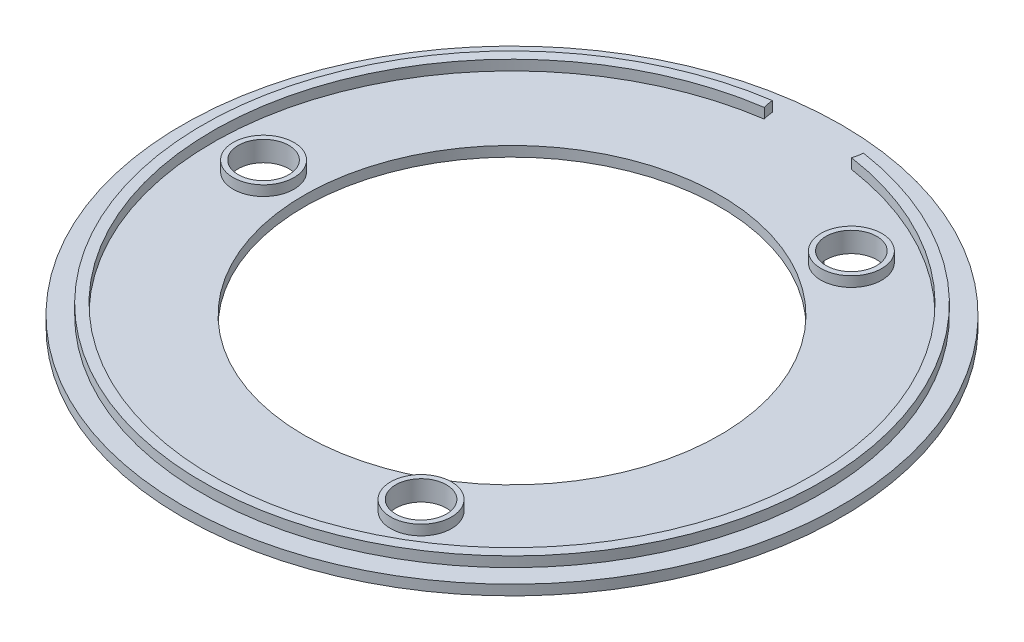
ISO-10303-21;
HEADER;
FILE_DESCRIPTION(('STEP AP214'),'2;1');
FILE_NAME('part.step','',(''),(''),'','','');
FILE_SCHEMA(('AUTOMOTIVE_DESIGN { 1 0 10303 214 1 1 1 1 }'));
ENDSEC;
DATA;
#1=APPLICATION_CONTEXT('core data for automotive mechanical design processes');
#2=APPLICATION_PROTOCOL_DEFINITION('international standard','automotive_design',2000,#1);
#3=PRODUCT_CONTEXT('',#1,'mechanical');
#4=PRODUCT('Part','Part','',(#3));
#5=PRODUCT_RELATED_PRODUCT_CATEGORY('part','',(#4));
#6=PRODUCT_DEFINITION_FORMATION('','',#4);
#7=PRODUCT_DEFINITION_CONTEXT('part definition',#1,'design');
#8=PRODUCT_DEFINITION('design','',#6,#7);
#9=PRODUCT_DEFINITION_SHAPE('','',#8);
#10=(LENGTH_UNIT() NAMED_UNIT(*) SI_UNIT(.MILLI.,.METRE.));
#11=(NAMED_UNIT(*) PLANE_ANGLE_UNIT() SI_UNIT($,.RADIAN.));
#12=(NAMED_UNIT(*) SI_UNIT($,.STERADIAN.) SOLID_ANGLE_UNIT());
#13=UNCERTAINTY_MEASURE_WITH_UNIT(LENGTH_MEASURE(1.E-05),#10,'distance_accuracy_value','');
#14=(GEOMETRIC_REPRESENTATION_CONTEXT(3) GLOBAL_UNCERTAINTY_ASSIGNED_CONTEXT((#13)) GLOBAL_UNIT_ASSIGNED_CONTEXT((#10,
#11,#12)) REPRESENTATION_CONTEXT('',''));
#15=CARTESIAN_POINT('',(0.,0.,0.));
#16=DIRECTION('',(0.,0.,1.));
#17=DIRECTION('',(1.,0.,0.));
#18=AXIS2_PLACEMENT_3D('',#15,#16,#17);
#19=CARTESIAN_POINT('',(0.,0.,0.));
#20=DIRECTION('',(0.,1.,0.));
#21=DIRECTION('',(0.,0.,1.));
#22=AXIS2_PLACEMENT_3D('',#19,#20,#21);
#23=PLANE('',#22);
#24=DIRECTION('',(-1.,0.,0.));
#25=VECTOR('',#24,1.);
#26=CARTESIAN_POINT('',(0.,0.,-2.99999999999996));
#27=LINE('',#26,#25);
#28=CARTESIAN_POINT('',(-22.8035085019828,0.,-3.));
#29=VERTEX_POINT('',#28);
#30=CARTESIAN_POINT('',(-23.3077240416133,0.,-3.));
#31=VERTEX_POINT('',#30);
#32=EDGE_CURVE('E186',#29,#31,#27,.T.);
#33=ORIENTED_EDGE('',*,*,#32,.F.);
#34=CARTESIAN_POINT('',(0.,0.,0.));
#35=DIRECTION('',(0.,-1.,0.));
#36=DIRECTION('',(0.,0.,-1.));
#37=AXIS2_PLACEMENT_3D('',#34,#35,#36);
#38=CIRCLE('',#37,23.);
#39=CARTESIAN_POINT('',(8.86867971969281,0.,-21.221369419279));
#40=VERTEX_POINT('',#39);
#41=EDGE_CURVE('E161',#29,#40,#38,.T.);
#42=ORIENTED_EDGE('',*,*,#41,.T.);
#43=DIRECTION('',(0.385594770421414,0.,-0.922668235620831));
#44=VECTOR('',#43,1.);
#45=CARTESIAN_POINT('',(2.81701067801042E-13,0.,1.17726452881649E-13));
#46=LINE('',#45,#44);
#47=CARTESIAN_POINT('',(9.06147710490351,0.,-21.6827035370894));
#48=VERTEX_POINT('',#47);
#49=EDGE_CURVE('E177',#40,#48,#46,.T.);
#50=ORIENTED_EDGE('',*,*,#49,.T.);
#51=CARTESIAN_POINT('',(0.,0.,0.));
#52=DIRECTION('',(0.,-1.,0.));
#53=DIRECTION('',(0.,0.,-1.));
#54=AXIS2_PLACEMENT_3D('',#51,#52,#53);
#55=CIRCLE('',#54,23.5);
#56=EDGE_CURVE('E54',#31,#48,#55,.T.);
#57=ORIENTED_EDGE('',*,*,#56,.F.);
#58=EDGE_LOOP('',(#33,#42,#50,#57));
#59=FACE_BOUND('',#58,.T.);
#60=DIRECTION('',(-0.611114112321888,0.,0.791542507842144));
#61=VECTOR('',#60,1.);
#62=CARTESIAN_POINT('',(1.5378802550578E-13,0.,1.18732767680297E-13));
#63=LINE('',#62,#61);
#64=CARTESIAN_POINT('',(14.3611816395645,0.,-18.6012489342903));
#65=VERTEX_POINT('',#64);
#66=CARTESIAN_POINT('',(14.0556245834036,0.,-18.2054776803692));
#67=VERTEX_POINT('',#66);
#68=EDGE_CURVE('E62',#65,#67,#63,.T.);
#69=ORIENTED_EDGE('',*,*,#68,.T.);
#70=CARTESIAN_POINT('',(0.,0.,0.));
#71=DIRECTION('',(0.,-1.,0.));
#72=DIRECTION('',(0.,0.,-1.));
#73=AXIS2_PLACEMENT_3D('',#70,#71,#72);
#74=CIRCLE('',#73,23.);
#75=CARTESIAN_POINT('',(13.9439051603436,0.,18.2911866449212));
#76=VERTEX_POINT('',#75);
#77=EDGE_CURVE('E164',#67,#76,#74,.T.);
#78=ORIENTED_EDGE('',*,*,#77,.T.);
#79=DIRECTION('',(-0.606256746101896,0.,-0.79526898456179));
#80=VECTOR('',#79,1.);
#81=CARTESIAN_POINT('',(0.,0.,0.));
#82=LINE('',#81,#80);
#83=CARTESIAN_POINT('',(14.2470335333946,0.,18.6888211372021));
#84=VERTEX_POINT('',#83);
#85=EDGE_CURVE('E197',#84,#76,#82,.T.);
#86=ORIENTED_EDGE('',*,*,#85,.F.);
#87=CARTESIAN_POINT('',(0.,0.,0.));
#88=DIRECTION('',(0.,-1.,0.));
#89=DIRECTION('',(0.,0.,-1.));
#90=AXIS2_PLACEMENT_3D('',#87,#88,#89);
#91=CIRCLE('',#90,23.5);
#92=EDGE_CURVE('E207',#65,#84,#91,.T.);
#93=ORIENTED_EDGE('',*,*,#92,.F.);
#94=EDGE_LOOP('',(#69,#78,#86,#93));
#95=FACE_BOUND('',#94,.T.);
#96=DIRECTION('',(0.385594770421372,0.,0.922668235620849));
#97=VECTOR('',#96,1.);
#98=CARTESIAN_POINT('',(1.23084159738071E-12,0.,-5.14384331056694E-13));
#99=LINE('',#98,#97);
#100=CARTESIAN_POINT('',(8.86867971969278,0.,21.221369419279));
#101=VERTEX_POINT('',#100);
#102=CARTESIAN_POINT('',(9.06147710490347,0.,21.6827035370894));
#103=VERTEX_POINT('',#102);
#104=EDGE_CURVE('E235',#101,#103,#99,.T.);
#105=ORIENTED_EDGE('',*,*,#104,.F.);
#106=CARTESIAN_POINT('',(0.,0.,0.));
#107=DIRECTION('',(0.,-1.,0.));
#108=DIRECTION('',(0.,0.,-1.));
#109=AXIS2_PLACEMENT_3D('',#106,#107,#108);
#110=CIRCLE('',#109,23.);
#111=CARTESIAN_POINT('',(-22.8035085019828,0.,3.));
#112=VERTEX_POINT('',#111);
#113=EDGE_CURVE('E222',#101,#112,#110,.T.);
#114=ORIENTED_EDGE('',*,*,#113,.T.);
#115=DIRECTION('',(1.,0.,0.));
#116=VECTOR('',#115,1.);
#117=CARTESIAN_POINT('',(0.,0.,3.));
#118=LINE('',#117,#116);
#119=CARTESIAN_POINT('',(-23.3077240416133,0.,3.));
#120=VERTEX_POINT('',#119);
#121=EDGE_CURVE('E227',#120,#112,#118,.T.);
#122=ORIENTED_EDGE('',*,*,#121,.F.);
#123=CARTESIAN_POINT('',(0.,0.,0.));
#124=DIRECTION('',(0.,-1.,0.));
#125=DIRECTION('',(0.,0.,-1.));
#126=AXIS2_PLACEMENT_3D('',#123,#124,#125);
#127=CIRCLE('',#126,23.5);
#128=EDGE_CURVE('E238',#103,#120,#127,.T.);
#129=ORIENTED_EDGE('',*,*,#128,.F.);
#130=EDGE_LOOP('',(#105,#114,#122,#129));
#131=FACE_BOUND('',#130,.T.);
#132=CARTESIAN_POINT('',(12.2500000000001,0.,21.2176223927187));
#133=DIRECTION('',(0.,1.,0.));
#134=DIRECTION('',(0.,0.,1.));
#135=AXIS2_PLACEMENT_3D('',#132,#133,#134);
#136=CIRCLE('',#135,2.5);
#137=CARTESIAN_POINT('',(12.2500000000001,0.,23.7176223927187));
#138=VERTEX_POINT('',#137);
#139=EDGE_CURVE('E257',#138,#138,#136,.F.);
#140=ORIENTED_EDGE('',*,*,#139,.F.);
#141=EDGE_LOOP('',(#140));
#142=FACE_BOUND('',#141,.T.);
#143=CARTESIAN_POINT('',(0.,0.,0.));
#144=DIRECTION('',(0.,1.,0.));
#145=DIRECTION('',(0.,0.,1.));
#146=AXIS2_PLACEMENT_3D('',#143,#144,#145);
#147=CIRCLE('',#146,20.5);
#148=CARTESIAN_POINT('',(0.,0.,20.5));
#149=VERTEX_POINT('',#148);
#150=EDGE_CURVE('E47',#149,#149,#147,.T.);
#151=ORIENTED_EDGE('',*,*,#150,.T.);
#152=EDGE_LOOP('',(#151));
#153=FACE_BOUND('',#152,.T.);
#154=CARTESIAN_POINT('',(0.,0.,0.));
#155=DIRECTION('',(0.,1.,0.));
#156=DIRECTION('',(0.,0.,1.));
#157=AXIS2_PLACEMENT_3D('',#154,#155,#156);
#158=CIRCLE('',#157,32.5);
#159=CARTESIAN_POINT('',(0.,0.,32.5));
#160=VERTEX_POINT('',#159);
#161=EDGE_CURVE('E11',#160,#160,#158,.T.);
#162=ORIENTED_EDGE('',*,*,#161,.F.);
#163=EDGE_LOOP('',(#162));
#164=FACE_BOUND('',#163,.T.);
#165=CARTESIAN_POINT('',(-24.5,0.,0.));
#166=DIRECTION('',(0.,1.,0.));
#167=DIRECTION('',(0.,0.,1.));
#168=AXIS2_PLACEMENT_3D('',#165,#166,#167);
#169=CIRCLE('',#168,2.5);
#170=CARTESIAN_POINT('',(-24.5,0.,2.5));
#171=VERTEX_POINT('',#170);
#172=EDGE_CURVE('E260',#171,#171,#169,.F.);
#173=ORIENTED_EDGE('',*,*,#172,.F.);
#174=EDGE_LOOP('',(#173));
#175=FACE_BOUND('',#174,.T.);
#176=CARTESIAN_POINT('',(12.2500000000001,0.,-21.2176223927187));
#177=DIRECTION('',(0.,1.,0.));
#178=DIRECTION('',(0.,0.,1.));
#179=AXIS2_PLACEMENT_3D('',#176,#177,#178);
#180=CIRCLE('',#179,2.5);
#181=CARTESIAN_POINT('',(12.2500000000001,0.,-18.7176223927187));
#182=VERTEX_POINT('',#181);
#183=EDGE_CURVE('E254',#182,#182,#180,.F.);
#184=ORIENTED_EDGE('',*,*,#183,.F.);
#185=EDGE_LOOP('',(#184));
#186=FACE_BOUND('',#185,.T.);
#187=ADVANCED_FACE('F39',(#59,#95,#131,#142,#153,#164,#175,#186),#23,.F.);
#188=CARTESIAN_POINT('',(0.,1.,0.));
#189=DIRECTION('',(0.,1.,0.));
#190=DIRECTION('',(0.,0.,1.));
#191=AXIS2_PLACEMENT_3D('',#188,#189,#190);
#192=PLANE('',#191);
#193=CARTESIAN_POINT('',(12.2500000000001,1.,21.2176223927187));
#194=DIRECTION('',(0.,1.,0.));
#195=DIRECTION('',(0.,0.,1.));
#196=AXIS2_PLACEMENT_3D('',#193,#194,#195);
#197=CIRCLE('',#196,3.);
#198=CARTESIAN_POINT('',(12.2500000000001,1.,24.2176223927187));
#199=VERTEX_POINT('',#198);
#200=EDGE_CURVE('E270',#199,#199,#197,.T.);
#201=ORIENTED_EDGE('',*,*,#200,.F.);
#202=EDGE_LOOP('',(#201));
#203=FACE_BOUND('',#202,.T.);
#204=CARTESIAN_POINT('',(12.2500000000001,1.,-21.2176223927187));
#205=DIRECTION('',(0.,1.,0.));
#206=DIRECTION('',(0.,0.,1.));
#207=AXIS2_PLACEMENT_3D('',#204,#205,#206);
#208=CIRCLE('',#207,2.99999999999999);
#209=CARTESIAN_POINT('',(12.2500000000001,1.,-18.2176223927187));
#210=VERTEX_POINT('',#209);
#211=EDGE_CURVE('E279',#210,#210,#208,.T.);
#212=ORIENTED_EDGE('',*,*,#211,.F.);
#213=EDGE_LOOP('',(#212));
#214=FACE_BOUND('',#213,.T.);
#215=CARTESIAN_POINT('',(0.,1.,0.));
#216=DIRECTION('',(0.,1.,0.));
#217=DIRECTION('',(0.,0.,1.));
#218=AXIS2_PLACEMENT_3D('',#215,#216,#217);
#219=CIRCLE('',#218,29.5);
#220=CARTESIAN_POINT('',(-4.30340163758787,1.,-29.1844262295082));
#221=VERTEX_POINT('',#220);
#222=CARTESIAN_POINT('',(4.30340163758787,1.,-29.1844262295082));
#223=VERTEX_POINT('',#222);
#224=EDGE_CURVE('E298',#221,#223,#219,.T.);
#225=ORIENTED_EDGE('',*,*,#224,.T.);
#226=CARTESIAN_POINT('',(0.,1.,-30.5));
#227=DIRECTION('',(0.,1.,0.));
#228=DIRECTION('',(0.,0.,1.));
#229=AXIS2_PLACEMENT_3D('',#226,#227,#228);
#230=CIRCLE('',#229,4.5);
#231=CARTESIAN_POINT('',(4.48773860306244,1.,-30.1680327868852));
#232=VERTEX_POINT('',#231);
#233=EDGE_CURVE('E301',#223,#232,#230,.T.);
#234=ORIENTED_EDGE('',*,*,#233,.T.);
#235=CARTESIAN_POINT('',(0.,1.,0.));
#236=DIRECTION('',(0.,1.,0.));
#237=DIRECTION('',(0.,0.,1.));
#238=AXIS2_PLACEMENT_3D('',#235,#236,#237);
#239=CIRCLE('',#238,30.5);
#240=CARTESIAN_POINT('',(-4.48773860306244,1.,-30.1680327868852));
#241=VERTEX_POINT('',#240);
#242=EDGE_CURVE('E304',#241,#232,#239,.T.);
#243=ORIENTED_EDGE('',*,*,#242,.F.);
#244=EDGE_CURVE('E305',#241,#221,#230,.T.);
#245=ORIENTED_EDGE('',*,*,#244,.T.);
#246=EDGE_LOOP('',(#225,#234,#243,#245));
#247=FACE_BOUND('',#246,.T.);
#248=CARTESIAN_POINT('',(0.,1.,0.));
#249=DIRECTION('',(0.,1.,0.));
#250=DIRECTION('',(0.,0.,1.));
#251=AXIS2_PLACEMENT_3D('',#248,#249,#250);
#252=CIRCLE('',#251,20.5);
#253=CARTESIAN_POINT('',(0.,1.,20.5));
#254=VERTEX_POINT('',#253);
#255=EDGE_CURVE('E294',#254,#254,#252,.F.);
#256=ORIENTED_EDGE('',*,*,#255,.T.);
#257=EDGE_LOOP('',(#256));
#258=FACE_BOUND('',#257,.T.);
#259=CARTESIAN_POINT('',(0.,1.,0.));
#260=DIRECTION('',(0.,1.,0.));
#261=DIRECTION('',(0.,0.,1.));
#262=AXIS2_PLACEMENT_3D('',#259,#260,#261);
#263=CIRCLE('',#262,32.5);
#264=CARTESIAN_POINT('',(0.,1.,32.5));
#265=VERTEX_POINT('',#264);
#266=EDGE_CURVE('E291',#265,#265,#263,.T.);
#267=ORIENTED_EDGE('',*,*,#266,.T.);
#268=EDGE_LOOP('',(#267));
#269=FACE_BOUND('',#268,.T.);
#270=CARTESIAN_POINT('',(-24.5,1.,0.));
#271=DIRECTION('',(0.,1.,0.));
#272=DIRECTION('',(0.,0.,1.));
#273=AXIS2_PLACEMENT_3D('',#270,#271,#272);
#274=CIRCLE('',#273,2.99999999999999);
#275=CARTESIAN_POINT('',(-24.5,1.,2.99999999999999));
#276=VERTEX_POINT('',#275);
#277=EDGE_CURVE('E263',#276,#276,#274,.T.);
#278=ORIENTED_EDGE('',*,*,#277,.F.);
#279=EDGE_LOOP('',(#278));
#280=FACE_BOUND('',#279,.T.);
#281=ADVANCED_FACE('F334',(#203,#214,#247,#258,#269,#280),#192,.T.);
#282=CARTESIAN_POINT('',(0.,2.,0.));
#283=DIRECTION('',(0.,-1.,0.));
#284=DIRECTION('',(0.,0.,-1.));
#285=AXIS2_PLACEMENT_3D('',#282,#283,#284);
#286=CYLINDRICAL_SURFACE('',#285,32.5);
#287=ORIENTED_EDGE('',*,*,#161,.T.);
#288=EDGE_LOOP('',(#287));
#289=FACE_BOUND('',#288,.T.);
#290=ORIENTED_EDGE('',*,*,#266,.F.);
#291=EDGE_LOOP('',(#290));
#292=FACE_BOUND('',#291,.T.);
#293=ADVANCED_FACE('F41',(#289,#292),#286,.T.);
#294=CARTESIAN_POINT('',(0.,2.,0.));
#295=DIRECTION('',(0.,-1.,0.));
#296=DIRECTION('',(0.,0.,-1.));
#297=AXIS2_PLACEMENT_3D('',#294,#295,#296);
#298=CYLINDRICAL_SURFACE('',#297,20.5);
#299=ORIENTED_EDGE('',*,*,#150,.F.);
#300=EDGE_LOOP('',(#299));
#301=FACE_BOUND('',#300,.T.);
#302=ORIENTED_EDGE('',*,*,#255,.F.);
#303=EDGE_LOOP('',(#302));
#304=FACE_BOUND('',#303,.T.);
#305=ADVANCED_FACE('F327',(#301,#304),#298,.F.);
#306=CARTESIAN_POINT('',(0.,1.,0.));
#307=DIRECTION('',(0.,1.,0.));
#308=DIRECTION('',(0.,0.,1.));
#309=AXIS2_PLACEMENT_3D('',#306,#307,#308);
#310=CYLINDRICAL_SURFACE('',#309,29.5);
#311=CARTESIAN_POINT('',(0.,2.,0.));
#312=DIRECTION('',(0.,1.,0.));
#313=DIRECTION('',(0.,0.,1.));
#314=AXIS2_PLACEMENT_3D('',#311,#312,#313);
#315=CIRCLE('',#314,29.5);
#316=CARTESIAN_POINT('',(-4.30340163758787,2.,-29.1844262295082));
#317=VERTEX_POINT('',#316);
#318=CARTESIAN_POINT('',(4.30340163758787,2.,-29.1844262295082));
#319=VERTEX_POINT('',#318);
#320=EDGE_CURVE('E288',#317,#319,#315,.T.);
#321=ORIENTED_EDGE('',*,*,#320,.T.);
#322=DIRECTION('',(0.,1.,0.));
#323=VECTOR('',#322,1.);
#324=CARTESIAN_POINT('',(4.30340163758787,1.,-29.1844262295082));
#325=LINE('',#324,#323);
#326=EDGE_CURVE('E320',#223,#319,#325,.T.);
#327=ORIENTED_EDGE('',*,*,#326,.F.);
#328=ORIENTED_EDGE('',*,*,#224,.F.);
#329=DIRECTION('',(0.,1.,0.));
#330=VECTOR('',#329,1.);
#331=CARTESIAN_POINT('',(-4.30340163758787,1.,-29.1844262295082));
#332=LINE('',#331,#330);
#333=EDGE_CURVE('E314',#221,#317,#332,.T.);
#334=ORIENTED_EDGE('',*,*,#333,.T.);
#335=EDGE_LOOP('',(#321,#327,#328,#334));
#336=FACE_BOUND('',#335,.T.);
#337=ADVANCED_FACE('F330',(#336),#310,.F.);
#338=CARTESIAN_POINT('',(0.,1.,-30.5));
#339=DIRECTION('',(0.,1.,0.));
#340=DIRECTION('',(0.,0.,1.));
#341=AXIS2_PLACEMENT_3D('',#338,#339,#340);
#342=CYLINDRICAL_SURFACE('',#341,4.5);
#343=CARTESIAN_POINT('',(0.,2.,-30.5));
#344=DIRECTION('',(0.,1.,0.));
#345=DIRECTION('',(0.,0.,1.));
#346=AXIS2_PLACEMENT_3D('',#343,#344,#345);
#347=CIRCLE('',#346,4.5);
#348=CARTESIAN_POINT('',(-4.48773860306244,2.,-30.1680327868852));
#349=VERTEX_POINT('',#348);
#350=EDGE_CURVE('E295',#349,#317,#347,.T.);
#351=ORIENTED_EDGE('',*,*,#350,.T.);
#352=ORIENTED_EDGE('',*,*,#333,.F.);
#353=ORIENTED_EDGE('',*,*,#244,.F.);
#354=DIRECTION('',(0.,1.,0.));
#355=VECTOR('',#354,1.);
#356=CARTESIAN_POINT('',(-4.48773860306244,1.,-30.1680327868852));
#357=LINE('',#356,#355);
#358=EDGE_CURVE('E316',#241,#349,#357,.T.);
#359=ORIENTED_EDGE('',*,*,#358,.T.);
#360=EDGE_LOOP('',(#351,#352,#353,#359));
#361=FACE_BOUND('',#360,.T.);
#362=ADVANCED_FACE('F373',(#361),#342,.F.);
#363=CARTESIAN_POINT('',(0.,1.,0.));
#364=DIRECTION('',(0.,1.,0.));
#365=DIRECTION('',(0.,0.,1.));
#366=AXIS2_PLACEMENT_3D('',#363,#364,#365);
#367=CYLINDRICAL_SURFACE('',#366,30.5);
#368=CARTESIAN_POINT('',(0.,2.,0.));
#369=DIRECTION('',(0.,1.,0.));
#370=DIRECTION('',(0.,0.,1.));
#371=AXIS2_PLACEMENT_3D('',#368,#369,#370);
#372=CIRCLE('',#371,30.5);
#373=CARTESIAN_POINT('',(4.48773860306244,2.,-30.1680327868852));
#374=VERTEX_POINT('',#373);
#375=EDGE_CURVE('E311',#349,#374,#372,.T.);
#376=ORIENTED_EDGE('',*,*,#375,.F.);
#377=ORIENTED_EDGE('',*,*,#358,.F.);
#378=ORIENTED_EDGE('',*,*,#242,.T.);
#379=DIRECTION('',(0.,1.,0.));
#380=VECTOR('',#379,1.);
#381=CARTESIAN_POINT('',(4.48773860306244,1.,-30.1680327868852));
#382=LINE('',#381,#380);
#383=EDGE_CURVE('E318',#232,#374,#382,.T.);
#384=ORIENTED_EDGE('',*,*,#383,.T.);
#385=EDGE_LOOP('',(#376,#377,#378,#384));
#386=FACE_BOUND('',#385,.T.);
#387=ADVANCED_FACE('F375',(#386),#367,.T.);
#388=EDGE_CURVE('E308',#319,#374,#347,.T.);
#389=ORIENTED_EDGE('',*,*,#388,.T.);
#390=ORIENTED_EDGE('',*,*,#383,.F.);
#391=ORIENTED_EDGE('',*,*,#233,.F.);
#392=ORIENTED_EDGE('',*,*,#326,.T.);
#393=EDGE_LOOP('',(#389,#390,#391,#392));
#394=FACE_BOUND('',#393,.T.);
#395=ADVANCED_FACE('F368',(#394),#342,.F.);
#396=CARTESIAN_POINT('',(0.,2.,0.));
#397=DIRECTION('',(0.,1.,0.));
#398=DIRECTION('',(0.,0.,1.));
#399=AXIS2_PLACEMENT_3D('',#396,#397,#398);
#400=PLANE('',#399);
#401=ORIENTED_EDGE('',*,*,#320,.F.);
#402=ORIENTED_EDGE('',*,*,#350,.F.);
#403=ORIENTED_EDGE('',*,*,#375,.T.);
#404=ORIENTED_EDGE('',*,*,#388,.F.);
#405=EDGE_LOOP('',(#401,#402,#403,#404));
#406=FACE_BOUND('',#405,.T.);
#407=ADVANCED_FACE('F365',(#406),#400,.T.);
#408=CARTESIAN_POINT('',(12.2500000000001,2.,-21.2176223927187));
#409=DIRECTION('',(0.,-1.,0.));
#410=DIRECTION('',(0.,0.,-1.));
#411=AXIS2_PLACEMENT_3D('',#408,#409,#410);
#412=CYLINDRICAL_SURFACE('',#411,2.99999999999999);
#413=CARTESIAN_POINT('',(12.2500000000001,2.,-21.2176223927187));
#414=DIRECTION('',(0.,1.,0.));
#415=DIRECTION('',(0.,0.,1.));
#416=AXIS2_PLACEMENT_3D('',#413,#414,#415);
#417=CIRCLE('',#416,2.99999999999999);
#418=CARTESIAN_POINT('',(12.2500000000001,2.,-18.2176223927187));
#419=VERTEX_POINT('',#418);
#420=EDGE_CURVE('E282',#419,#419,#417,.T.);
#421=ORIENTED_EDGE('',*,*,#420,.F.);
#422=EDGE_LOOP('',(#421));
#423=FACE_BOUND('',#422,.T.);
#424=ORIENTED_EDGE('',*,*,#211,.T.);
#425=EDGE_LOOP('',(#424));
#426=FACE_BOUND('',#425,.T.);
#427=ADVANCED_FACE('F367',(#423,#426),#412,.T.);
#428=CARTESIAN_POINT('',(12.2500000000001,2.,-21.2176223927187));
#429=DIRECTION('',(0.,-1.,0.));
#430=DIRECTION('',(0.,0.,-1.));
#431=AXIS2_PLACEMENT_3D('',#428,#429,#430);
#432=CYLINDRICAL_SURFACE('',#431,2.49999999999999);
#433=CARTESIAN_POINT('',(12.2500000000001,2.,-21.2176223927187));
#434=DIRECTION('',(0.,1.,0.));
#435=DIRECTION('',(0.,0.,1.));
#436=AXIS2_PLACEMENT_3D('',#433,#434,#435);
#437=CIRCLE('',#436,2.49999999999999);
#438=CARTESIAN_POINT('',(12.2500000000001,2.,-18.7176223927187));
#439=VERTEX_POINT('',#438);
#440=EDGE_CURVE('E285',#439,#439,#437,.T.);
#441=ORIENTED_EDGE('',*,*,#440,.T.);
#442=EDGE_LOOP('',(#441));
#443=FACE_BOUND('',#442,.T.);
#444=ORIENTED_EDGE('',*,*,#183,.T.);
#445=EDGE_LOOP('',(#444));
#446=FACE_BOUND('',#445,.T.);
#447=ADVANCED_FACE('F384',(#443,#446),#432,.F.);
#448=CARTESIAN_POINT('',(0.,2.,0.));
#449=DIRECTION('',(0.,1.,0.));
#450=DIRECTION('',(0.,0.,1.));
#451=AXIS2_PLACEMENT_3D('',#448,#449,#450);
#452=PLANE('',#451);
#453=ORIENTED_EDGE('',*,*,#420,.T.);
#454=EDGE_LOOP('',(#453));
#455=FACE_BOUND('',#454,.T.);
#456=ORIENTED_EDGE('',*,*,#440,.F.);
#457=EDGE_LOOP('',(#456));
#458=FACE_BOUND('',#457,.T.);
#459=ADVANCED_FACE('F388',(#455,#458),#452,.T.);
#460=CARTESIAN_POINT('',(12.2500000000001,2.,21.2176223927187));
#461=DIRECTION('',(0.,-1.,0.));
#462=DIRECTION('',(0.,0.,-1.));
#463=AXIS2_PLACEMENT_3D('',#460,#461,#462);
#464=CYLINDRICAL_SURFACE('',#463,3.);
#465=CARTESIAN_POINT('',(12.2500000000001,2.,21.2176223927187));
#466=DIRECTION('',(0.,1.,0.));
#467=DIRECTION('',(0.,0.,1.));
#468=AXIS2_PLACEMENT_3D('',#465,#466,#467);
#469=CIRCLE('',#468,3.);
#470=CARTESIAN_POINT('',(12.2500000000001,2.,24.2176223927187));
#471=VERTEX_POINT('',#470);
#472=EDGE_CURVE('E273',#471,#471,#469,.T.);
#473=ORIENTED_EDGE('',*,*,#472,.F.);
#474=EDGE_LOOP('',(#473));
#475=FACE_BOUND('',#474,.T.);
#476=ORIENTED_EDGE('',*,*,#200,.T.);
#477=EDGE_LOOP('',(#476));
#478=FACE_BOUND('',#477,.T.);
#479=ADVANCED_FACE('F392',(#475,#478),#464,.T.);
#480=CARTESIAN_POINT('',(12.2500000000001,2.,21.2176223927187));
#481=DIRECTION('',(0.,-1.,0.));
#482=DIRECTION('',(0.,0.,-1.));
#483=AXIS2_PLACEMENT_3D('',#480,#481,#482);
#484=CYLINDRICAL_SURFACE('',#483,2.49999999999999);
#485=CARTESIAN_POINT('',(12.2500000000001,2.,21.2176223927187));
#486=DIRECTION('',(0.,1.,0.));
#487=DIRECTION('',(0.,0.,1.));
#488=AXIS2_PLACEMENT_3D('',#485,#486,#487);
#489=CIRCLE('',#488,2.49999999999999);
#490=CARTESIAN_POINT('',(12.2500000000001,2.,23.7176223927187));
#491=VERTEX_POINT('',#490);
#492=EDGE_CURVE('E276',#491,#491,#489,.T.);
#493=ORIENTED_EDGE('',*,*,#492,.T.);
#494=EDGE_LOOP('',(#493));
#495=FACE_BOUND('',#494,.T.);
#496=ORIENTED_EDGE('',*,*,#139,.T.);
#497=EDGE_LOOP('',(#496));
#498=FACE_BOUND('',#497,.T.);
#499=ADVANCED_FACE('F396',(#495,#498),#484,.F.);
#500=CARTESIAN_POINT('',(0.,2.,0.));
#501=DIRECTION('',(0.,1.,0.));
#502=DIRECTION('',(0.,0.,1.));
#503=AXIS2_PLACEMENT_3D('',#500,#501,#502);
#504=PLANE('',#503);
#505=ORIENTED_EDGE('',*,*,#472,.T.);
#506=EDGE_LOOP('',(#505));
#507=FACE_BOUND('',#506,.T.);
#508=ORIENTED_EDGE('',*,*,#492,.F.);
#509=EDGE_LOOP('',(#508));
#510=FACE_BOUND('',#509,.T.);
#511=ADVANCED_FACE('F356',(#507,#510),#504,.T.);
#512=CARTESIAN_POINT('',(-24.5,2.,0.));
#513=DIRECTION('',(0.,-1.,0.));
#514=DIRECTION('',(0.,0.,-1.));
#515=AXIS2_PLACEMENT_3D('',#512,#513,#514);
#516=CYLINDRICAL_SURFACE('',#515,2.5);
#517=CARTESIAN_POINT('',(-24.5,2.,0.));
#518=DIRECTION('',(0.,1.,0.));
#519=DIRECTION('',(0.,0.,1.));
#520=AXIS2_PLACEMENT_3D('',#517,#518,#519);
#521=CIRCLE('',#520,2.5);
#522=CARTESIAN_POINT('',(-24.5,2.,2.5));
#523=VERTEX_POINT('',#522);
#524=EDGE_CURVE('E264',#523,#523,#521,.T.);
#525=ORIENTED_EDGE('',*,*,#524,.T.);
#526=EDGE_LOOP('',(#525));
#527=FACE_BOUND('',#526,.T.);
#528=ORIENTED_EDGE('',*,*,#172,.T.);
#529=EDGE_LOOP('',(#528));
#530=FACE_BOUND('',#529,.T.);
#531=ADVANCED_FACE('F346',(#527,#530),#516,.F.);
#532=CARTESIAN_POINT('',(-24.5,2.,0.));
#533=DIRECTION('',(0.,-1.,0.));
#534=DIRECTION('',(0.,0.,-1.));
#535=AXIS2_PLACEMENT_3D('',#532,#533,#534);
#536=CYLINDRICAL_SURFACE('',#535,2.99999999999999);
#537=CARTESIAN_POINT('',(-24.5,2.,0.));
#538=DIRECTION('',(0.,1.,0.));
#539=DIRECTION('',(0.,0.,1.));
#540=AXIS2_PLACEMENT_3D('',#537,#538,#539);
#541=CIRCLE('',#540,2.99999999999999);
#542=CARTESIAN_POINT('',(-24.5,2.,2.99999999999999));
#543=VERTEX_POINT('',#542);
#544=EDGE_CURVE('E267',#543,#543,#541,.T.);
#545=ORIENTED_EDGE('',*,*,#544,.F.);
#546=EDGE_LOOP('',(#545));
#547=FACE_BOUND('',#546,.T.);
#548=ORIENTED_EDGE('',*,*,#277,.T.);
#549=EDGE_LOOP('',(#548));
#550=FACE_BOUND('',#549,.T.);
#551=ADVANCED_FACE('F343',(#547,#550),#536,.T.);
#552=CARTESIAN_POINT('',(0.,2.,0.));
#553=DIRECTION('',(0.,1.,0.));
#554=DIRECTION('',(0.,0.,1.));
#555=AXIS2_PLACEMENT_3D('',#552,#553,#554);
#556=PLANE('',#555);
#557=ORIENTED_EDGE('',*,*,#524,.F.);
#558=EDGE_LOOP('',(#557));
#559=FACE_BOUND('',#558,.T.);
#560=ORIENTED_EDGE('',*,*,#544,.T.);
#561=EDGE_LOOP('',(#560));
#562=FACE_BOUND('',#561,.T.);
#563=ADVANCED_FACE('F345',(#559,#562),#556,.T.);
#564=CARTESIAN_POINT('',(0.,-1.,0.));
#565=DIRECTION('',(0.,1.,0.));
#566=DIRECTION('',(0.,0.,1.));
#567=AXIS2_PLACEMENT_3D('',#564,#565,#566);
#568=CYLINDRICAL_SURFACE('',#567,23.);
#569=ORIENTED_EDGE('',*,*,#113,.F.);
#570=DIRECTION('',(0.,1.,0.));
#571=VECTOR('',#570,1.);
#572=CARTESIAN_POINT('',(8.86867971969278,-1.,21.221369419279));
#573=LINE('',#572,#571);
#574=CARTESIAN_POINT('',(8.86867971969278,-1.,21.221369419279));
#575=VERTEX_POINT('',#574);
#576=EDGE_CURVE('E251',#575,#101,#573,.T.);
#577=ORIENTED_EDGE('',*,*,#576,.F.);
#578=CARTESIAN_POINT('',(0.,-1.,0.));
#579=DIRECTION('',(0.,-1.,0.));
#580=DIRECTION('',(0.,0.,-1.));
#581=AXIS2_PLACEMENT_3D('',#578,#579,#580);
#582=CIRCLE('',#581,23.);
#583=CARTESIAN_POINT('',(-22.8035085019828,-1.,3.));
#584=VERTEX_POINT('',#583);
#585=EDGE_CURVE('E223',#575,#584,#582,.T.);
#586=ORIENTED_EDGE('',*,*,#585,.T.);
#587=DIRECTION('',(0.,1.,0.));
#588=VECTOR('',#587,1.);
#589=CARTESIAN_POINT('',(-22.8035085019828,-1.,3.));
#590=LINE('',#589,#588);
#591=EDGE_CURVE('E233',#584,#112,#590,.T.);
#592=ORIENTED_EDGE('',*,*,#591,.T.);
#593=EDGE_LOOP('',(#569,#577,#586,#592));
#594=FACE_BOUND('',#593,.T.);
#595=ADVANCED_FACE('F353',(#594),#568,.F.);
#596=CARTESIAN_POINT('',(1.23084159738071E-12,-1.,-5.14384331056694E-13));
#597=DIRECTION('',(-0.922668235620849,0.,0.385594770421372));
#598=DIRECTION('',(0.385594770421372,0.,0.922668235620849));
#599=AXIS2_PLACEMENT_3D('',#596,#597,#598);
#600=PLANE('',#599);
#601=ORIENTED_EDGE('',*,*,#104,.T.);
#602=DIRECTION('',(0.,1.,0.));
#603=VECTOR('',#602,1.);
#604=CARTESIAN_POINT('',(9.06147710490347,-1.,21.6827035370894));
#605=LINE('',#604,#603);
#606=CARTESIAN_POINT('',(9.06147710490347,-1.,21.6827035370894));
#607=VERTEX_POINT('',#606);
#608=EDGE_CURVE('E248',#607,#103,#605,.T.);
#609=ORIENTED_EDGE('',*,*,#608,.F.);
#610=DIRECTION('',(0.385594770421372,0.,0.922668235620849));
#611=VECTOR('',#610,1.);
#612=CARTESIAN_POINT('',(1.23084159738071E-12,-1.,-5.14384331056694E-13));
#613=LINE('',#612,#611);
#614=EDGE_CURVE('E226',#575,#607,#613,.T.);
#615=ORIENTED_EDGE('',*,*,#614,.F.);
#616=ORIENTED_EDGE('',*,*,#576,.T.);
#617=EDGE_LOOP('',(#601,#609,#615,#616));
#618=FACE_BOUND('',#617,.T.);
#619=ADVANCED_FACE('F481',(#618),#600,.F.);
#620=CARTESIAN_POINT('',(0.,-1.,0.));
#621=DIRECTION('',(0.,1.,0.));
#622=DIRECTION('',(0.,0.,1.));
#623=AXIS2_PLACEMENT_3D('',#620,#621,#622);
#624=CYLINDRICAL_SURFACE('',#623,23.5);
#625=ORIENTED_EDGE('',*,*,#128,.T.);
#626=DIRECTION('',(0.,1.,0.));
#627=VECTOR('',#626,1.);
#628=CARTESIAN_POINT('',(-23.3077240416133,-1.,3.));
#629=LINE('',#628,#627);
#630=CARTESIAN_POINT('',(-23.3077240416133,-1.,3.));
#631=VERTEX_POINT('',#630);
#632=EDGE_CURVE('E245',#631,#120,#629,.T.);
#633=ORIENTED_EDGE('',*,*,#632,.F.);
#634=CARTESIAN_POINT('',(0.,-1.,0.));
#635=DIRECTION('',(0.,-1.,0.));
#636=DIRECTION('',(0.,0.,-1.));
#637=AXIS2_PLACEMENT_3D('',#634,#635,#636);
#638=CIRCLE('',#637,23.5);
#639=EDGE_CURVE('E229',#607,#631,#638,.T.);
#640=ORIENTED_EDGE('',*,*,#639,.F.);
#641=ORIENTED_EDGE('',*,*,#608,.T.);
#642=EDGE_LOOP('',(#625,#633,#640,#641));
#643=FACE_BOUND('',#642,.T.);
#644=ADVANCED_FACE('F491',(#643),#624,.T.);
#645=CARTESIAN_POINT('',(0.,-1.,3.));
#646=DIRECTION('',(0.,0.,1.));
#647=DIRECTION('',(1.,0.,0.));
#648=AXIS2_PLACEMENT_3D('',#645,#646,#647);
#649=PLANE('',#648);
#650=ORIENTED_EDGE('',*,*,#121,.T.);
#651=ORIENTED_EDGE('',*,*,#591,.F.);
#652=DIRECTION('',(1.,0.,0.));
#653=VECTOR('',#652,1.);
#654=CARTESIAN_POINT('',(0.,-1.,3.));
#655=LINE('',#654,#653);
#656=EDGE_CURVE('E231',#631,#584,#655,.T.);
#657=ORIENTED_EDGE('',*,*,#656,.F.);
#658=ORIENTED_EDGE('',*,*,#632,.T.);
#659=EDGE_LOOP('',(#650,#651,#657,#658));
#660=FACE_BOUND('',#659,.T.);
#661=ADVANCED_FACE('F501',(#660),#649,.F.);
#662=CARTESIAN_POINT('',(0.,-1.,0.));
#663=DIRECTION('',(0.,-1.,0.));
#664=DIRECTION('',(0.,0.,-1.));
#665=AXIS2_PLACEMENT_3D('',#662,#663,#664);
#666=PLANE('',#665);
#667=ORIENTED_EDGE('',*,*,#585,.F.);
#668=ORIENTED_EDGE('',*,*,#614,.T.);
#669=ORIENTED_EDGE('',*,*,#639,.T.);
#670=ORIENTED_EDGE('',*,*,#656,.T.);
#671=EDGE_LOOP('',(#667,#668,#669,#670));
#672=FACE_BOUND('',#671,.T.);
#673=ADVANCED_FACE('F511',(#672),#666,.T.);
#674=CARTESIAN_POINT('',(0.,-1.,0.));
#675=DIRECTION('',(0.,1.,0.));
#676=DIRECTION('',(0.,0.,1.));
#677=AXIS2_PLACEMENT_3D('',#674,#675,#676);
#678=CYLINDRICAL_SURFACE('',#677,23.);
#679=ORIENTED_EDGE('',*,*,#77,.F.);
#680=DIRECTION('',(0.,1.,0.));
#681=VECTOR('',#680,1.);
#682=CARTESIAN_POINT('',(14.0556245834036,-1.,-18.2054776803692));
#683=LINE('',#682,#681);
#684=CARTESIAN_POINT('',(14.0556245834036,-1.,-18.2054776803692));
#685=VERTEX_POINT('',#684);
#686=EDGE_CURVE('E220',#685,#67,#683,.T.);
#687=ORIENTED_EDGE('',*,*,#686,.F.);
#688=CARTESIAN_POINT('',(0.,-1.,0.));
#689=DIRECTION('',(0.,-1.,0.));
#690=DIRECTION('',(0.,0.,-1.));
#691=AXIS2_PLACEMENT_3D('',#688,#689,#690);
#692=CIRCLE('',#691,23.);
#693=CARTESIAN_POINT('',(13.9439051603436,-1.,18.2911866449212));
#694=VERTEX_POINT('',#693);
#695=EDGE_CURVE('E193',#685,#694,#692,.T.);
#696=ORIENTED_EDGE('',*,*,#695,.T.);
#697=DIRECTION('',(0.,1.,0.));
#698=VECTOR('',#697,1.);
#699=CARTESIAN_POINT('',(13.9439051603436,-1.,18.2911866449212));
#700=LINE('',#699,#698);
#701=EDGE_CURVE('E204',#694,#76,#700,.T.);
#702=ORIENTED_EDGE('',*,*,#701,.T.);
#703=EDGE_LOOP('',(#679,#687,#696,#702));
#704=FACE_BOUND('',#703,.T.);
#705=ADVANCED_FACE('F521',(#704),#678,.F.);
#706=CARTESIAN_POINT('',(1.5378802550578E-13,-1.,1.18732767680297E-13));
#707=DIRECTION('',(-0.791542507842144,0.,-0.611114112321888));
#708=DIRECTION('',(-0.611114112321888,0.,0.791542507842144));
#709=AXIS2_PLACEMENT_3D('',#706,#707,#708);
#710=PLANE('',#709);
#711=ORIENTED_EDGE('',*,*,#68,.F.);
#712=DIRECTION('',(0.,1.,0.));
#713=VECTOR('',#712,1.);
#714=CARTESIAN_POINT('',(14.3611816395645,-1.,-18.6012489342903));
#715=LINE('',#714,#713);
#716=CARTESIAN_POINT('',(14.3611816395645,-1.,-18.6012489342903));
#717=VERTEX_POINT('',#716);
#718=EDGE_CURVE('E217',#717,#65,#715,.T.);
#719=ORIENTED_EDGE('',*,*,#718,.F.);
#720=DIRECTION('',(-0.611114112321888,0.,0.791542507842144));
#721=VECTOR('',#720,1.);
#722=CARTESIAN_POINT('',(1.5378802550578E-13,-1.,1.18732767680297E-13));
#723=LINE('',#722,#721);
#724=EDGE_CURVE('E196',#717,#685,#723,.T.);
#725=ORIENTED_EDGE('',*,*,#724,.T.);
#726=ORIENTED_EDGE('',*,*,#686,.T.);
#727=EDGE_LOOP('',(#711,#719,#725,#726));
#728=FACE_BOUND('',#727,.T.);
#729=ADVANCED_FACE('F531',(#728),#710,.T.);
#730=CARTESIAN_POINT('',(0.,-1.,0.));
#731=DIRECTION('',(0.,1.,0.));
#732=DIRECTION('',(0.,0.,1.));
#733=AXIS2_PLACEMENT_3D('',#730,#731,#732);
#734=CYLINDRICAL_SURFACE('',#733,23.5);
#735=ORIENTED_EDGE('',*,*,#92,.T.);
#736=DIRECTION('',(0.,1.,0.));
#737=VECTOR('',#736,1.);
#738=CARTESIAN_POINT('',(14.2470335333945,-1.,18.6888211372021));
#739=LINE('',#738,#737);
#740=CARTESIAN_POINT('',(14.2470335333945,-1.,18.6888211372021));
#741=VERTEX_POINT('',#740);
#742=EDGE_CURVE('E214',#741,#84,#739,.T.);
#743=ORIENTED_EDGE('',*,*,#742,.F.);
#744=CARTESIAN_POINT('',(0.,-1.,0.));
#745=DIRECTION('',(0.,-1.,0.));
#746=DIRECTION('',(0.,0.,-1.));
#747=AXIS2_PLACEMENT_3D('',#744,#745,#746);
#748=CIRCLE('',#747,23.5);
#749=EDGE_CURVE('E200',#717,#741,#748,.T.);
#750=ORIENTED_EDGE('',*,*,#749,.F.);
#751=ORIENTED_EDGE('',*,*,#718,.T.);
#752=EDGE_LOOP('',(#735,#743,#750,#751));
#753=FACE_BOUND('',#752,.T.);
#754=ADVANCED_FACE('F541',(#753),#734,.T.);
#755=CARTESIAN_POINT('',(0.,-1.,0.));
#756=DIRECTION('',(0.79526898456179,0.,-0.606256746101896));
#757=DIRECTION('',(-0.606256746101896,0.,-0.79526898456179));
#758=AXIS2_PLACEMENT_3D('',#755,#756,#757);
#759=PLANE('',#758);
#760=ORIENTED_EDGE('',*,*,#85,.T.);
#761=ORIENTED_EDGE('',*,*,#701,.F.);
#762=DIRECTION('',(-0.606256746101896,0.,-0.79526898456179));
#763=VECTOR('',#762,1.);
#764=CARTESIAN_POINT('',(0.,-1.,0.));
#765=LINE('',#764,#763);
#766=EDGE_CURVE('E202',#741,#694,#765,.T.);
#767=ORIENTED_EDGE('',*,*,#766,.F.);
#768=ORIENTED_EDGE('',*,*,#742,.T.);
#769=EDGE_LOOP('',(#760,#761,#767,#768));
#770=FACE_BOUND('',#769,.T.);
#771=ADVANCED_FACE('F551',(#770),#759,.F.);
#772=CARTESIAN_POINT('',(0.,-1.,0.));
#773=DIRECTION('',(0.,-1.,0.));
#774=DIRECTION('',(0.,0.,-1.));
#775=AXIS2_PLACEMENT_3D('',#772,#773,#774);
#776=PLANE('',#775);
#777=ORIENTED_EDGE('',*,*,#695,.F.);
#778=ORIENTED_EDGE('',*,*,#724,.F.);
#779=ORIENTED_EDGE('',*,*,#749,.T.);
#780=ORIENTED_EDGE('',*,*,#766,.T.);
#781=EDGE_LOOP('',(#777,#778,#779,#780));
#782=FACE_BOUND('',#781,.T.);
#783=ADVANCED_FACE('F561',(#782),#776,.T.);
#784=CARTESIAN_POINT('',(0.,-1.,0.));
#785=DIRECTION('',(0.,1.,0.));
#786=DIRECTION('',(0.,0.,1.));
#787=AXIS2_PLACEMENT_3D('',#784,#785,#786);
#788=CYLINDRICAL_SURFACE('',#787,23.);
#789=ORIENTED_EDGE('',*,*,#41,.F.);
#790=DIRECTION('',(0.,1.,0.));
#791=VECTOR('',#790,1.);
#792=CARTESIAN_POINT('',(-22.8035085019828,-1.,-3.));
#793=LINE('',#792,#791);
#794=CARTESIAN_POINT('',(-22.8035085019828,-1.,-3.));
#795=VERTEX_POINT('',#794);
#796=EDGE_CURVE('E154',#795,#29,#793,.T.);
#797=ORIENTED_EDGE('',*,*,#796,.F.);
#798=CARTESIAN_POINT('',(0.,-1.,0.));
#799=DIRECTION('',(0.,-1.,0.));
#800=DIRECTION('',(0.,0.,-1.));
#801=AXIS2_PLACEMENT_3D('',#798,#799,#800);
#802=CIRCLE('',#801,23.);
#803=CARTESIAN_POINT('',(8.86867971969281,-1.,-21.221369419279));
#804=VERTEX_POINT('',#803);
#805=EDGE_CURVE('E158',#795,#804,#802,.T.);
#806=ORIENTED_EDGE('',*,*,#805,.T.);
#807=DIRECTION('',(0.,1.,0.));
#808=VECTOR('',#807,1.);
#809=CARTESIAN_POINT('',(8.86867971969281,-1.,-21.221369419279));
#810=LINE('',#809,#808);
#811=EDGE_CURVE('E184',#804,#40,#810,.T.);
#812=ORIENTED_EDGE('',*,*,#811,.T.);
#813=EDGE_LOOP('',(#789,#797,#806,#812));
#814=FACE_BOUND('',#813,.T.);
#815=ADVANCED_FACE('F156',(#814),#788,.F.);
#816=CARTESIAN_POINT('',(0.,-1.,-2.99999999999996));
#817=DIRECTION('',(0.,0.,-1.));
#818=DIRECTION('',(-1.,0.,0.));
#819=AXIS2_PLACEMENT_3D('',#816,#817,#818);
#820=PLANE('',#819);
#821=ORIENTED_EDGE('',*,*,#32,.T.);
#822=DIRECTION('',(0.,1.,0.));
#823=VECTOR('',#822,1.);
#824=CARTESIAN_POINT('',(-23.3077240416133,-1.,-3.));
#825=LINE('',#824,#823);
#826=CARTESIAN_POINT('',(-23.3077240416133,-1.,-3.));
#827=VERTEX_POINT('',#826);
#828=EDGE_CURVE('E165',#827,#31,#825,.T.);
#829=ORIENTED_EDGE('',*,*,#828,.F.);
#830=DIRECTION('',(-1.,0.,0.));
#831=VECTOR('',#830,1.);
#832=CARTESIAN_POINT('',(0.,-1.,-2.99999999999996));
#833=LINE('',#832,#831);
#834=EDGE_CURVE('E168',#795,#827,#833,.T.);
#835=ORIENTED_EDGE('',*,*,#834,.F.);
#836=ORIENTED_EDGE('',*,*,#796,.T.);
#837=EDGE_LOOP('',(#821,#829,#835,#836));
#838=FACE_BOUND('',#837,.T.);
#839=ADVANCED_FACE('F169',(#838),#820,.F.);
#840=CARTESIAN_POINT('',(0.,-1.,0.));
#841=DIRECTION('',(0.,1.,0.));
#842=DIRECTION('',(0.,0.,1.));
#843=AXIS2_PLACEMENT_3D('',#840,#841,#842);
#844=CYLINDRICAL_SURFACE('',#843,23.5);
#845=ORIENTED_EDGE('',*,*,#56,.T.);
#846=DIRECTION('',(0.,1.,0.));
#847=VECTOR('',#846,1.);
#848=CARTESIAN_POINT('',(9.06147710490351,-1.,-21.6827035370894));
#849=LINE('',#848,#847);
#850=CARTESIAN_POINT('',(9.06147710490351,-1.,-21.6827035370894));
#851=VERTEX_POINT('',#850);
#852=EDGE_CURVE('E190',#851,#48,#849,.T.);
#853=ORIENTED_EDGE('',*,*,#852,.F.);
#854=CARTESIAN_POINT('',(0.,-1.,0.));
#855=DIRECTION('',(0.,-1.,0.));
#856=DIRECTION('',(0.,0.,-1.));
#857=AXIS2_PLACEMENT_3D('',#854,#855,#856);
#858=CIRCLE('',#857,23.5);
#859=EDGE_CURVE('E172',#827,#851,#858,.T.);
#860=ORIENTED_EDGE('',*,*,#859,.F.);
#861=ORIENTED_EDGE('',*,*,#828,.T.);
#862=EDGE_LOOP('',(#845,#853,#860,#861));
#863=FACE_BOUND('',#862,.T.);
#864=ADVANCED_FACE('F588',(#863),#844,.T.);
#865=CARTESIAN_POINT('',(2.81701067801042E-13,-1.,1.17726452881649E-13));
#866=DIRECTION('',(0.922668235620831,0.,0.385594770421414));
#867=DIRECTION('',(0.385594770421414,0.,-0.922668235620831));
#868=AXIS2_PLACEMENT_3D('',#865,#866,#867);
#869=PLANE('',#868);
#870=ORIENTED_EDGE('',*,*,#49,.F.);
#871=ORIENTED_EDGE('',*,*,#811,.F.);
#872=DIRECTION('',(0.385594770421414,0.,-0.922668235620831));
#873=VECTOR('',#872,1.);
#874=CARTESIAN_POINT('',(2.81701067801042E-13,-1.,1.17726452881649E-13));
#875=LINE('',#874,#873);
#876=EDGE_CURVE('E176',#804,#851,#875,.T.);
#877=ORIENTED_EDGE('',*,*,#876,.T.);
#878=ORIENTED_EDGE('',*,*,#852,.T.);
#879=EDGE_LOOP('',(#870,#871,#877,#878));
#880=FACE_BOUND('',#879,.T.);
#881=ADVANCED_FACE('F597',(#880),#869,.T.);
#882=CARTESIAN_POINT('',(0.,-1.,0.));
#883=DIRECTION('',(0.,-1.,0.));
#884=DIRECTION('',(0.,0.,-1.));
#885=AXIS2_PLACEMENT_3D('',#882,#883,#884);
#886=PLANE('',#885);
#887=ORIENTED_EDGE('',*,*,#805,.F.);
#888=ORIENTED_EDGE('',*,*,#834,.T.);
#889=ORIENTED_EDGE('',*,*,#859,.T.);
#890=ORIENTED_EDGE('',*,*,#876,.F.);
#891=EDGE_LOOP('',(#887,#888,#889,#890));
#892=FACE_BOUND('',#891,.T.);
#893=ADVANCED_FACE('F174',(#892),#886,.T.);
#894=CLOSED_SHELL('',(#187,#281,#293,#305,#337,#362,#387,#395,#407,#427,#447,#459,#479,#499,
#511,#531,#551,#563,#595,#619,#644,#661,#673,#705,#729,#754,#771,#783,#815,#839,#864,#881,#893));
#895=MANIFOLD_SOLID_BREP('B2',#894);
#896=ADVANCED_BREP_SHAPE_REPRESENTATION('',(#18,#895),#14);
#897=SHAPE_DEFINITION_REPRESENTATION(#9,#896);
ENDSEC;
END-ISO-10303-21;
